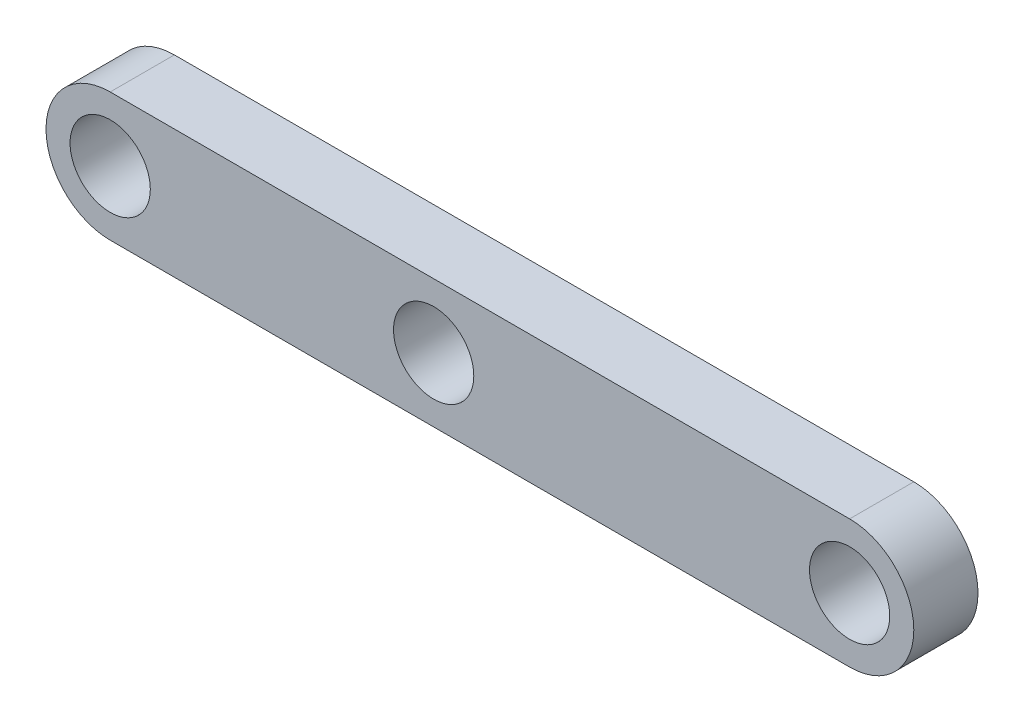
ISO-10303-21;
HEADER;
FILE_DESCRIPTION(('STEP AP214'),'2;1');
FILE_NAME('part.step','',(''),(''),'','','');
FILE_SCHEMA(('AUTOMOTIVE_DESIGN { 1 0 10303 214 1 1 1 1 }'));
ENDSEC;
DATA;
#1=APPLICATION_CONTEXT('core data for automotive mechanical design processes');
#2=APPLICATION_PROTOCOL_DEFINITION('international standard','automotive_design',2000,#1);
#3=PRODUCT_CONTEXT('',#1,'mechanical');
#4=PRODUCT('Part','Part','',(#3));
#5=PRODUCT_RELATED_PRODUCT_CATEGORY('part','',(#4));
#6=PRODUCT_DEFINITION_FORMATION('','',#4);
#7=PRODUCT_DEFINITION_CONTEXT('part definition',#1,'design');
#8=PRODUCT_DEFINITION('design','',#6,#7);
#9=PRODUCT_DEFINITION_SHAPE('','',#8);
#10=(LENGTH_UNIT() NAMED_UNIT(*) SI_UNIT(.MILLI.,.METRE.));
#11=(NAMED_UNIT(*) PLANE_ANGLE_UNIT() SI_UNIT($,.RADIAN.));
#12=(NAMED_UNIT(*) SI_UNIT($,.STERADIAN.) SOLID_ANGLE_UNIT());
#13=UNCERTAINTY_MEASURE_WITH_UNIT(LENGTH_MEASURE(1.E-05),#10,'distance_accuracy_value','');
#14=(GEOMETRIC_REPRESENTATION_CONTEXT(3) GLOBAL_UNCERTAINTY_ASSIGNED_CONTEXT((#13)) GLOBAL_UNIT_ASSIGNED_CONTEXT((#10,
#11,#12)) REPRESENTATION_CONTEXT('',''));
#15=CARTESIAN_POINT('',(0.,0.,0.));
#16=DIRECTION('',(0.,0.,1.));
#17=DIRECTION('',(1.,0.,0.));
#18=AXIS2_PLACEMENT_3D('',#15,#16,#17);
#19=CARTESIAN_POINT('',(28.575,0.,3.175));
#20=DIRECTION('',(0.,0.,1.));
#21=DIRECTION('',(1.,0.,0.));
#22=AXIS2_PLACEMENT_3D('',#19,#20,#21);
#23=PLANE('',#22);
#24=CARTESIAN_POINT('',(-8.,0.,3.175));
#25=DIRECTION('',(0.,0.,1.));
#26=DIRECTION('',(1.,0.,0.));
#27=AXIS2_PLACEMENT_3D('',#24,#25,#26);
#28=CIRCLE('',#27,1.984375);
#29=CARTESIAN_POINT('',(-6.015625,0.,3.175));
#30=VERTEX_POINT('',#29);
#31=EDGE_CURVE('E117',#30,#30,#28,.T.);
#32=ORIENTED_EDGE('',*,*,#31,.F.);
#33=EDGE_LOOP('',(#32));
#34=FACE_BOUND('',#33,.T.);
#35=CARTESIAN_POINT('',(28.575,0.,3.175));
#36=DIRECTION('',(0.,0.,1.));
#37=DIRECTION('',(1.,0.,0.));
#38=AXIS2_PLACEMENT_3D('',#35,#36,#37);
#39=CIRCLE('',#38,3.175);
#40=CARTESIAN_POINT('',(28.575,-3.175,3.175));
#41=VERTEX_POINT('',#40);
#42=CARTESIAN_POINT('',(28.575,3.175,3.175));
#43=VERTEX_POINT('',#42);
#44=EDGE_CURVE('E87',#41,#43,#39,.T.);
#45=ORIENTED_EDGE('',*,*,#44,.T.);
#46=DIRECTION('',(-1.,0.,0.));
#47=VECTOR('',#46,1.);
#48=CARTESIAN_POINT('',(-8.,3.175,3.175));
#49=LINE('',#48,#47);
#50=CARTESIAN_POINT('',(-8.,3.175,3.175));
#51=VERTEX_POINT('',#50);
#52=EDGE_CURVE('E82',#43,#51,#49,.T.);
#53=ORIENTED_EDGE('',*,*,#52,.T.);
#54=CARTESIAN_POINT('',(-8.,0.,3.175));
#55=DIRECTION('',(0.,0.,1.));
#56=DIRECTION('',(1.,0.,0.));
#57=AXIS2_PLACEMENT_3D('',#54,#55,#56);
#58=CIRCLE('',#57,3.175);
#59=CARTESIAN_POINT('',(-8.,-3.175,3.175));
#60=VERTEX_POINT('',#59);
#61=EDGE_CURVE('E85',#51,#60,#58,.T.);
#62=ORIENTED_EDGE('',*,*,#61,.T.);
#63=DIRECTION('',(1.,0.,0.));
#64=VECTOR('',#63,1.);
#65=CARTESIAN_POINT('',(-8.,-3.175,3.175));
#66=LINE('',#65,#64);
#67=EDGE_CURVE('E52',#60,#41,#66,.T.);
#68=ORIENTED_EDGE('',*,*,#67,.T.);
#69=EDGE_LOOP('',(#45,#53,#62,#68));
#70=FACE_BOUND('',#69,.T.);
#71=CARTESIAN_POINT('',(8.,0.,3.175));
#72=DIRECTION('',(0.,0.,1.));
#73=DIRECTION('',(1.,0.,0.));
#74=AXIS2_PLACEMENT_3D('',#71,#72,#73);
#75=CIRCLE('',#74,1.984375);
#76=CARTESIAN_POINT('',(9.984375,0.,3.175));
#77=VERTEX_POINT('',#76);
#78=EDGE_CURVE('E102',#77,#77,#75,.T.);
#79=ORIENTED_EDGE('',*,*,#78,.F.);
#80=EDGE_LOOP('',(#79));
#81=FACE_BOUND('',#80,.T.);
#82=CARTESIAN_POINT('',(28.575,0.,3.175));
#83=DIRECTION('',(0.,0.,1.));
#84=DIRECTION('',(1.,0.,0.));
#85=AXIS2_PLACEMENT_3D('',#82,#83,#84);
#86=CIRCLE('',#85,1.984375);
#87=CARTESIAN_POINT('',(30.559375,0.,3.175));
#88=VERTEX_POINT('',#87);
#89=EDGE_CURVE('E123',#88,#88,#86,.T.);
#90=ORIENTED_EDGE('',*,*,#89,.F.);
#91=EDGE_LOOP('',(#90));
#92=FACE_BOUND('',#91,.T.);
#93=ADVANCED_FACE('F35',(#34,#70,#81,#92),#23,.T.);
#94=CARTESIAN_POINT('',(28.575,0.,0.));
#95=DIRECTION('',(0.,0.,1.));
#96=DIRECTION('',(1.,0.,0.));
#97=AXIS2_PLACEMENT_3D('',#94,#95,#96);
#98=PLANE('',#97);
#99=CARTESIAN_POINT('',(-8.,0.,0.));
#100=DIRECTION('',(0.,0.,1.));
#101=DIRECTION('',(1.,0.,0.));
#102=AXIS2_PLACEMENT_3D('',#99,#100,#101);
#103=CIRCLE('',#102,1.984375);
#104=CARTESIAN_POINT('',(-6.015625,0.,0.));
#105=VERTEX_POINT('',#104);
#106=EDGE_CURVE('E120',#105,#105,#103,.T.);
#107=ORIENTED_EDGE('',*,*,#106,.T.);
#108=EDGE_LOOP('',(#107));
#109=FACE_BOUND('',#108,.T.);
#110=CARTESIAN_POINT('',(28.575,0.,0.));
#111=DIRECTION('',(0.,0.,1.));
#112=DIRECTION('',(1.,0.,0.));
#113=AXIS2_PLACEMENT_3D('',#110,#111,#112);
#114=CIRCLE('',#113,3.175);
#115=CARTESIAN_POINT('',(28.575,-3.175,0.));
#116=VERTEX_POINT('',#115);
#117=CARTESIAN_POINT('',(28.575,3.175,0.));
#118=VERTEX_POINT('',#117);
#119=EDGE_CURVE('E99',#116,#118,#114,.T.);
#120=ORIENTED_EDGE('',*,*,#119,.F.);
#121=DIRECTION('',(1.,0.,0.));
#122=VECTOR('',#121,1.);
#123=CARTESIAN_POINT('',(-8.,-3.175,0.));
#124=LINE('',#123,#122);
#125=CARTESIAN_POINT('',(-8.,-3.175,0.));
#126=VERTEX_POINT('',#125);
#127=EDGE_CURVE('E75',#126,#116,#124,.T.);
#128=ORIENTED_EDGE('',*,*,#127,.F.);
#129=CARTESIAN_POINT('',(-8.,0.,0.));
#130=DIRECTION('',(0.,0.,1.));
#131=DIRECTION('',(1.,0.,0.));
#132=AXIS2_PLACEMENT_3D('',#129,#130,#131);
#133=CIRCLE('',#132,3.175);
#134=CARTESIAN_POINT('',(-8.,3.175,0.));
#135=VERTEX_POINT('',#134);
#136=EDGE_CURVE('E69',#135,#126,#133,.T.);
#137=ORIENTED_EDGE('',*,*,#136,.F.);
#138=DIRECTION('',(-1.,0.,0.));
#139=VECTOR('',#138,1.);
#140=CARTESIAN_POINT('',(-8.,3.175,0.));
#141=LINE('',#140,#139);
#142=EDGE_CURVE('E91',#118,#135,#141,.T.);
#143=ORIENTED_EDGE('',*,*,#142,.F.);
#144=EDGE_LOOP('',(#120,#128,#137,#143));
#145=FACE_BOUND('',#144,.T.);
#146=CARTESIAN_POINT('',(8.,0.,0.));
#147=DIRECTION('',(0.,0.,1.));
#148=DIRECTION('',(1.,0.,0.));
#149=AXIS2_PLACEMENT_3D('',#146,#147,#148);
#150=CIRCLE('',#149,1.984375);
#151=CARTESIAN_POINT('',(9.984375,0.,0.));
#152=VERTEX_POINT('',#151);
#153=EDGE_CURVE('E114',#152,#152,#150,.T.);
#154=ORIENTED_EDGE('',*,*,#153,.T.);
#155=EDGE_LOOP('',(#154));
#156=FACE_BOUND('',#155,.T.);
#157=CARTESIAN_POINT('',(28.575,0.,0.));
#158=DIRECTION('',(0.,0.,1.));
#159=DIRECTION('',(1.,0.,0.));
#160=AXIS2_PLACEMENT_3D('',#157,#158,#159);
#161=CIRCLE('',#160,1.984375);
#162=CARTESIAN_POINT('',(30.559375,0.,0.));
#163=VERTEX_POINT('',#162);
#164=EDGE_CURVE('E126',#163,#163,#161,.T.);
#165=ORIENTED_EDGE('',*,*,#164,.T.);
#166=EDGE_LOOP('',(#165));
#167=FACE_BOUND('',#166,.T.);
#168=ADVANCED_FACE('F110',(#109,#145,#156,#167),#98,.F.);
#169=CARTESIAN_POINT('',(28.575,0.,3.175));
#170=DIRECTION('',(0.,0.,-1.));
#171=DIRECTION('',(-1.,0.,0.));
#172=AXIS2_PLACEMENT_3D('',#169,#170,#171);
#173=CYLINDRICAL_SURFACE('',#172,3.175);
#174=ORIENTED_EDGE('',*,*,#119,.T.);
#175=DIRECTION('',(0.,0.,-1.));
#176=VECTOR('',#175,1.);
#177=CARTESIAN_POINT('',(28.575,3.175,3.175));
#178=LINE('',#177,#176);
#179=EDGE_CURVE('E11',#43,#118,#178,.T.);
#180=ORIENTED_EDGE('',*,*,#179,.F.);
#181=ORIENTED_EDGE('',*,*,#44,.F.);
#182=DIRECTION('',(0.,0.,-1.));
#183=VECTOR('',#182,1.);
#184=CARTESIAN_POINT('',(28.575,-3.175,3.175));
#185=LINE('',#184,#183);
#186=EDGE_CURVE('E95',#41,#116,#185,.T.);
#187=ORIENTED_EDGE('',*,*,#186,.T.);
#188=EDGE_LOOP('',(#174,#180,#181,#187));
#189=FACE_BOUND('',#188,.T.);
#190=ADVANCED_FACE('F37',(#189),#173,.T.);
#191=CARTESIAN_POINT('',(-8.,3.175,3.175));
#192=DIRECTION('',(0.,-1.,0.));
#193=DIRECTION('',(0.,0.,-1.));
#194=AXIS2_PLACEMENT_3D('',#191,#192,#193);
#195=PLANE('',#194);
#196=ORIENTED_EDGE('',*,*,#142,.T.);
#197=DIRECTION('',(0.,0.,-1.));
#198=VECTOR('',#197,1.);
#199=CARTESIAN_POINT('',(-8.,3.175,3.175));
#200=LINE('',#199,#198);
#201=EDGE_CURVE('E44',#51,#135,#200,.T.);
#202=ORIENTED_EDGE('',*,*,#201,.F.);
#203=ORIENTED_EDGE('',*,*,#52,.F.);
#204=ORIENTED_EDGE('',*,*,#179,.T.);
#205=EDGE_LOOP('',(#196,#202,#203,#204));
#206=FACE_BOUND('',#205,.T.);
#207=ADVANCED_FACE('F90',(#206),#195,.F.);
#208=CARTESIAN_POINT('',(-8.,0.,3.175));
#209=DIRECTION('',(0.,0.,-1.));
#210=DIRECTION('',(-1.,0.,0.));
#211=AXIS2_PLACEMENT_3D('',#208,#209,#210);
#212=CYLINDRICAL_SURFACE('',#211,3.175);
#213=ORIENTED_EDGE('',*,*,#136,.T.);
#214=DIRECTION('',(0.,0.,-1.));
#215=VECTOR('',#214,1.);
#216=CARTESIAN_POINT('',(-8.,-3.175,3.175));
#217=LINE('',#216,#215);
#218=EDGE_CURVE('E92',#60,#126,#217,.T.);
#219=ORIENTED_EDGE('',*,*,#218,.F.);
#220=ORIENTED_EDGE('',*,*,#61,.F.);
#221=ORIENTED_EDGE('',*,*,#201,.T.);
#222=EDGE_LOOP('',(#213,#219,#220,#221));
#223=FACE_BOUND('',#222,.T.);
#224=ADVANCED_FACE('F93',(#223),#212,.T.);
#225=CARTESIAN_POINT('',(-8.,-3.175,3.175));
#226=DIRECTION('',(0.,1.,0.));
#227=DIRECTION('',(0.,0.,1.));
#228=AXIS2_PLACEMENT_3D('',#225,#226,#227);
#229=PLANE('',#228);
#230=ORIENTED_EDGE('',*,*,#127,.T.);
#231=ORIENTED_EDGE('',*,*,#186,.F.);
#232=ORIENTED_EDGE('',*,*,#67,.F.);
#233=ORIENTED_EDGE('',*,*,#218,.T.);
#234=EDGE_LOOP('',(#230,#231,#232,#233));
#235=FACE_BOUND('',#234,.T.);
#236=ADVANCED_FACE('F107',(#235),#229,.F.);
#237=CARTESIAN_POINT('',(8.,0.,3.175));
#238=DIRECTION('',(0.,0.,-1.));
#239=DIRECTION('',(-1.,0.,0.));
#240=AXIS2_PLACEMENT_3D('',#237,#238,#239);
#241=CYLINDRICAL_SURFACE('',#240,1.984375);
#242=ORIENTED_EDGE('',*,*,#78,.T.);
#243=EDGE_LOOP('',(#242));
#244=FACE_BOUND('',#243,.T.);
#245=ORIENTED_EDGE('',*,*,#153,.F.);
#246=EDGE_LOOP('',(#245));
#247=FACE_BOUND('',#246,.T.);
#248=ADVANCED_FACE('F145',(#244,#247),#241,.F.);
#249=CARTESIAN_POINT('',(-8.,0.,3.175));
#250=DIRECTION('',(0.,0.,-1.));
#251=DIRECTION('',(-1.,0.,0.));
#252=AXIS2_PLACEMENT_3D('',#249,#250,#251);
#253=CYLINDRICAL_SURFACE('',#252,1.984375);
#254=ORIENTED_EDGE('',*,*,#31,.T.);
#255=EDGE_LOOP('',(#254));
#256=FACE_BOUND('',#255,.T.);
#257=ORIENTED_EDGE('',*,*,#106,.F.);
#258=EDGE_LOOP('',(#257));
#259=FACE_BOUND('',#258,.T.);
#260=ADVANCED_FACE('F191',(#256,#259),#253,.F.);
#261=CARTESIAN_POINT('',(28.575,0.,3.175));
#262=DIRECTION('',(0.,0.,-1.));
#263=DIRECTION('',(-1.,0.,0.));
#264=AXIS2_PLACEMENT_3D('',#261,#262,#263);
#265=CYLINDRICAL_SURFACE('',#264,1.984375);
#266=ORIENTED_EDGE('',*,*,#89,.T.);
#267=EDGE_LOOP('',(#266));
#268=FACE_BOUND('',#267,.T.);
#269=ORIENTED_EDGE('',*,*,#164,.F.);
#270=EDGE_LOOP('',(#269));
#271=FACE_BOUND('',#270,.T.);
#272=ADVANCED_FACE('F132',(#268,#271),#265,.F.);
#273=CLOSED_SHELL('',(#93,#168,#190,#207,#224,#236,#248,#260,#272));
#274=MANIFOLD_SOLID_BREP('B2',#273);
#275=ADVANCED_BREP_SHAPE_REPRESENTATION('',(#18,#274),#14);
#276=SHAPE_DEFINITION_REPRESENTATION(#9,#275);
ENDSEC;
END-ISO-10303-21;
